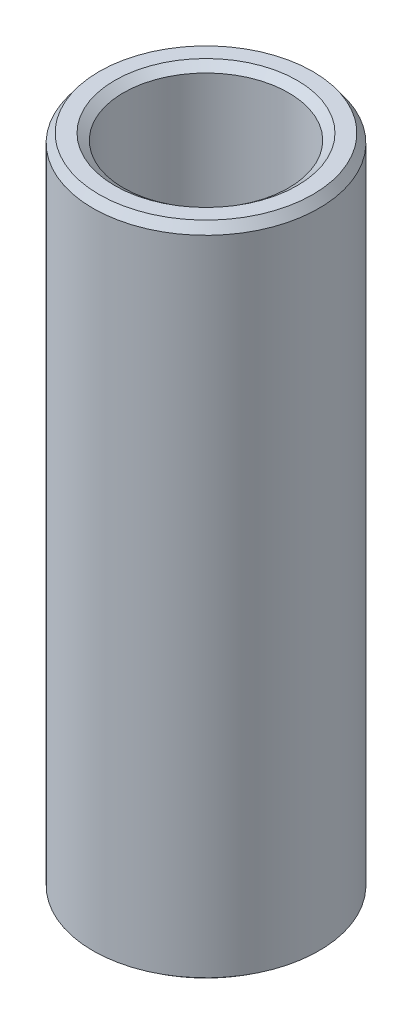
ISO-10303-21;
HEADER;
FILE_DESCRIPTION(('STEP AP214'),'2;1');
FILE_NAME('part.step','',(''),(''),'','','');
FILE_SCHEMA(('AUTOMOTIVE_DESIGN { 1 0 10303 214 1 1 1 1 }'));
ENDSEC;
DATA;
#1=APPLICATION_CONTEXT('core data for automotive mechanical design processes');
#2=APPLICATION_PROTOCOL_DEFINITION('international standard','automotive_design',2000,#1);
#3=PRODUCT_CONTEXT('',#1,'mechanical');
#4=PRODUCT('Part','Part','',(#3));
#5=PRODUCT_RELATED_PRODUCT_CATEGORY('part','',(#4));
#6=PRODUCT_DEFINITION_FORMATION('','',#4);
#7=PRODUCT_DEFINITION_CONTEXT('part definition',#1,'design');
#8=PRODUCT_DEFINITION('design','',#6,#7);
#9=PRODUCT_DEFINITION_SHAPE('','',#8);
#10=(LENGTH_UNIT() NAMED_UNIT(*) SI_UNIT(.MILLI.,.METRE.));
#11=(NAMED_UNIT(*) PLANE_ANGLE_UNIT() SI_UNIT($,.RADIAN.));
#12=(NAMED_UNIT(*) SI_UNIT($,.STERADIAN.) SOLID_ANGLE_UNIT());
#13=UNCERTAINTY_MEASURE_WITH_UNIT(LENGTH_MEASURE(1.E-05),#10,'distance_accuracy_value','');
#14=(GEOMETRIC_REPRESENTATION_CONTEXT(3) GLOBAL_UNCERTAINTY_ASSIGNED_CONTEXT((#13)) GLOBAL_UNIT_ASSIGNED_CONTEXT((#10,
#11,#12)) REPRESENTATION_CONTEXT('',''));
#15=CARTESIAN_POINT('',(0.,0.,0.));
#16=DIRECTION('',(0.,0.,1.));
#17=DIRECTION('',(1.,0.,0.));
#18=AXIS2_PLACEMENT_3D('',#15,#16,#17);
#19=CARTESIAN_POINT('',(0.,290.987460242659,0.));
#20=DIRECTION('',(0.,-1.,0.));
#21=DIRECTION('',(0.,0.,-1.));
#22=AXIS2_PLACEMENT_3D('',#19,#20,#21);
#23=CYLINDRICAL_SURFACE('',#22,50.);
#24=CARTESIAN_POINT('',(0.,2.81648633931247,0.));
#25=DIRECTION('',(0.,1.,0.));
#26=DIRECTION('',(0.,0.,1.));
#27=AXIS2_PLACEMENT_3D('',#24,#25,#26);
#28=CIRCLE('',#27,50.);
#29=CARTESIAN_POINT('',(0.,2.81648633931247,50.));
#30=VERTEX_POINT('',#29);
#31=EDGE_CURVE('E10',#30,#30,#28,.T.);
#32=ORIENTED_EDGE('',*,*,#31,.T.);
#33=EDGE_LOOP('',(#32));
#34=FACE_BOUND('',#33,.T.);
#35=CARTESIAN_POINT('',(0.,287.152034430774,0.));
#36=DIRECTION('',(0.,1.,0.));
#37=DIRECTION('',(0.,0.,1.));
#38=AXIS2_PLACEMENT_3D('',#35,#36,#37);
#39=CIRCLE('',#38,50.);
#40=CARTESIAN_POINT('',(0.,287.152034430774,50.));
#41=VERTEX_POINT('',#40);
#42=EDGE_CURVE('E50',#41,#41,#39,.F.);
#43=ORIENTED_EDGE('',*,*,#42,.T.);
#44=EDGE_LOOP('',(#43));
#45=FACE_BOUND('',#44,.T.);
#46=ADVANCED_FACE('F39',(#34,#45),#23,.T.);
#47=CARTESIAN_POINT('',(0.,290.987460242659,0.));
#48=DIRECTION('',(0.,1.,0.));
#49=DIRECTION('',(0.,0.,1.));
#50=AXIS2_PLACEMENT_3D('',#47,#48,#49);
#51=PLANE('',#50);
#52=CARTESIAN_POINT('',(0.,290.987460242659,0.));
#53=DIRECTION('',(0.,1.,0.));
#54=DIRECTION('',(0.,0.,1.));
#55=AXIS2_PLACEMENT_3D('',#52,#53,#54);
#56=CIRCLE('',#55,40.3378824782618);
#57=CARTESIAN_POINT('',(0.,290.987460242659,40.3378824782618));
#58=VERTEX_POINT('',#57);
#59=EDGE_CURVE('E58',#58,#58,#56,.F.);
#60=ORIENTED_EDGE('',*,*,#59,.T.);
#61=EDGE_LOOP('',(#60));
#62=FACE_BOUND('',#61,.T.);
#63=CARTESIAN_POINT('',(0.,290.987460242659,0.));
#64=DIRECTION('',(0.,1.,0.));
#65=DIRECTION('',(0.,0.,1.));
#66=AXIS2_PLACEMENT_3D('',#63,#64,#65);
#67=CIRCLE('',#66,47.1835136606875);
#68=CARTESIAN_POINT('',(0.,290.987460242659,47.1835136606875));
#69=VERTEX_POINT('',#68);
#70=EDGE_CURVE('E61',#69,#69,#67,.T.);
#71=ORIENTED_EDGE('',*,*,#70,.T.);
#72=EDGE_LOOP('',(#71));
#73=FACE_BOUND('',#72,.T.);
#74=ADVANCED_FACE('F88',(#62,#73),#51,.T.);
#75=CARTESIAN_POINT('',(0.,0.,0.));
#76=DIRECTION('',(0.,1.,0.));
#77=DIRECTION('',(0.,0.,1.));
#78=AXIS2_PLACEMENT_3D('',#75,#76,#77);
#79=PLANE('',#78);
#80=CARTESIAN_POINT('',(0.,0.,0.));
#81=DIRECTION('',(0.,1.,0.));
#82=DIRECTION('',(0.,0.,1.));
#83=AXIS2_PLACEMENT_3D('',#80,#81,#82);
#84=CIRCLE('',#83,39.3189430056884);
#85=CARTESIAN_POINT('',(0.,0.,39.3189430056884));
#86=VERTEX_POINT('',#85);
#87=EDGE_CURVE('E51',#86,#86,#84,.T.);
#88=ORIENTED_EDGE('',*,*,#87,.T.);
#89=EDGE_LOOP('',(#88));
#90=FACE_BOUND('',#89,.T.);
#91=CARTESIAN_POINT('',(0.,0.,0.));
#92=DIRECTION('',(0.,1.,0.));
#93=DIRECTION('',(0.,0.,1.));
#94=AXIS2_PLACEMENT_3D('',#91,#92,#93);
#95=CIRCLE('',#94,46.1645741881142);
#96=CARTESIAN_POINT('',(0.,0.,46.1645741881142));
#97=VERTEX_POINT('',#96);
#98=EDGE_CURVE('E54',#97,#97,#95,.F.);
#99=ORIENTED_EDGE('',*,*,#98,.T.);
#100=EDGE_LOOP('',(#99));
#101=FACE_BOUND('',#100,.T.);
#102=ADVANCED_FACE('F83',(#90,#101),#79,.F.);
#103=CARTESIAN_POINT('',(0.,290.987460242659,0.));
#104=DIRECTION('',(0.,-1.,0.));
#105=DIRECTION('',(0.,0.,-1.));
#106=AXIS2_PLACEMENT_3D('',#103,#104,#105);
#107=CYLINDRICAL_SURFACE('',#106,36.502456666376);
#108=CARTESIAN_POINT('',(0.,288.170973903347,0.));
#109=DIRECTION('',(0.,1.,0.));
#110=DIRECTION('',(0.,0.,1.));
#111=AXIS2_PLACEMENT_3D('',#108,#109,#110);
#112=CIRCLE('',#111,36.502456666376);
#113=CARTESIAN_POINT('',(0.,288.170973903347,36.502456666376));
#114=VERTEX_POINT('',#113);
#115=EDGE_CURVE('E67',#114,#114,#112,.T.);
#116=ORIENTED_EDGE('',*,*,#115,.T.);
#117=EDGE_LOOP('',(#116));
#118=FACE_BOUND('',#117,.T.);
#119=CARTESIAN_POINT('',(0.,3.83542581188584,0.));
#120=DIRECTION('',(0.,1.,0.));
#121=DIRECTION('',(0.,0.,1.));
#122=AXIS2_PLACEMENT_3D('',#119,#120,#121);
#123=CIRCLE('',#122,36.502456666376);
#124=CARTESIAN_POINT('',(0.,3.83542581188584,36.502456666376));
#125=VERTEX_POINT('',#124);
#126=EDGE_CURVE('E69',#125,#125,#123,.F.);
#127=ORIENTED_EDGE('',*,*,#126,.T.);
#128=EDGE_LOOP('',(#127));
#129=FACE_BOUND('',#128,.T.);
#130=ADVANCED_FACE('F71',(#118,#129),#107,.F.);
#131=CARTESIAN_POINT('',(0.,288.170973903347,0.));
#132=DIRECTION('',(0.,1.,0.));
#133=DIRECTION('',(0.,0.,1.));
#134=AXIS2_PLACEMENT_3D('',#131,#132,#133);
#135=CONICAL_SURFACE('',#134,36.502456666376,0.937396612011817);
#136=ORIENTED_EDGE('',*,*,#59,.F.);
#137=EDGE_LOOP('',(#136));
#138=FACE_BOUND('',#137,.T.);
#139=ORIENTED_EDGE('',*,*,#115,.F.);
#140=EDGE_LOOP('',(#139));
#141=FACE_BOUND('',#140,.T.);
#142=ADVANCED_FACE('F77',(#138,#141),#135,.F.);
#143=CARTESIAN_POINT('',(0.,0.,0.));
#144=DIRECTION('',(0.,-1.,0.));
#145=DIRECTION('',(0.,0.,-1.));
#146=AXIS2_PLACEMENT_3D('',#143,#144,#145);
#147=CONICAL_SURFACE('',#146,39.3189430056884,0.633399714783084);
#148=ORIENTED_EDGE('',*,*,#126,.F.);
#149=EDGE_LOOP('',(#148));
#150=FACE_BOUND('',#149,.T.);
#151=ORIENTED_EDGE('',*,*,#87,.F.);
#152=EDGE_LOOP('',(#151));
#153=FACE_BOUND('',#152,.T.);
#154=ADVANCED_FACE('F73',(#150,#153),#147,.F.);
#155=CARTESIAN_POINT('',(0.,2.81648633931247,0.));
#156=DIRECTION('',(0.,1.,0.));
#157=DIRECTION('',(0.,0.,1.));
#158=AXIS2_PLACEMENT_3D('',#155,#156,#157);
#159=CONICAL_SURFACE('',#158,50.,0.937396612011812);
#160=ORIENTED_EDGE('',*,*,#98,.F.);
#161=EDGE_LOOP('',(#160));
#162=FACE_BOUND('',#161,.T.);
#163=ORIENTED_EDGE('',*,*,#31,.F.);
#164=EDGE_LOOP('',(#163));
#165=FACE_BOUND('',#164,.T.);
#166=ADVANCED_FACE('F76',(#162,#165),#159,.T.);
#167=CARTESIAN_POINT('',(0.,290.987460242659,0.));
#168=DIRECTION('',(0.,-1.,0.));
#169=DIRECTION('',(0.,0.,-1.));
#170=AXIS2_PLACEMENT_3D('',#167,#168,#169);
#171=CONICAL_SURFACE('',#170,47.1835136606875,0.633399714783081);
#172=ORIENTED_EDGE('',*,*,#42,.F.);
#173=EDGE_LOOP('',(#172));
#174=FACE_BOUND('',#173,.T.);
#175=ORIENTED_EDGE('',*,*,#70,.F.);
#176=EDGE_LOOP('',(#175));
#177=FACE_BOUND('',#176,.T.);
#178=ADVANCED_FACE('F45',(#174,#177),#171,.T.);
#179=CLOSED_SHELL('',(#46,#74,#102,#130,#142,#154,#166,#178));
#180=MANIFOLD_SOLID_BREP('B2',#179);
#181=ADVANCED_BREP_SHAPE_REPRESENTATION('',(#18,#180),#14);
#182=SHAPE_DEFINITION_REPRESENTATION(#9,#181);
ENDSEC;
END-ISO-10303-21;
